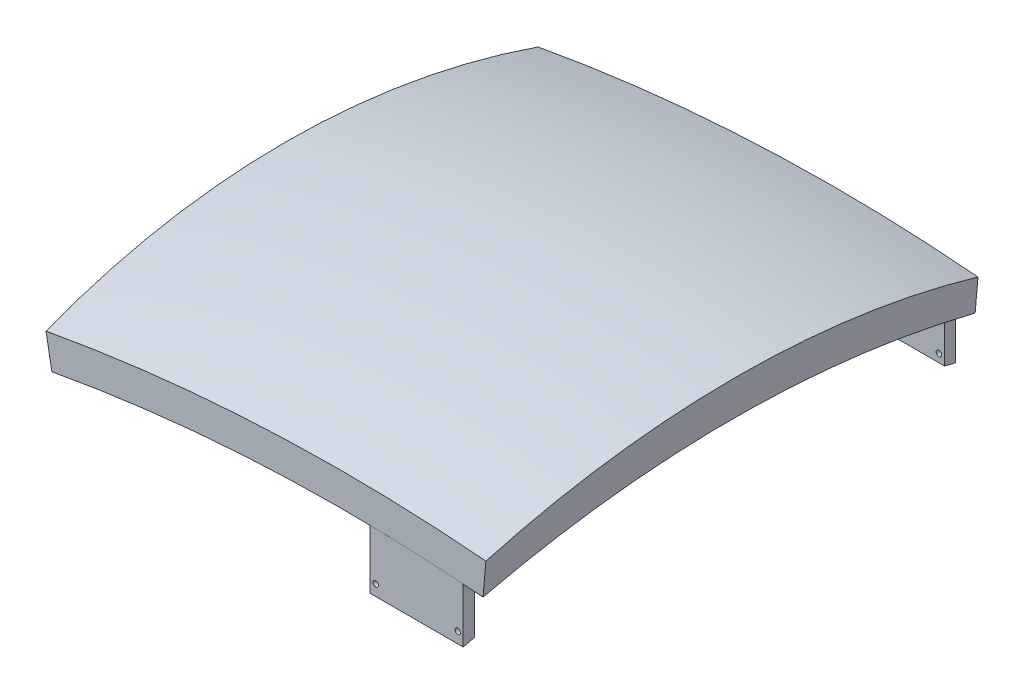
ISO-10303-21;
HEADER;
FILE_DESCRIPTION(('STEP AP214'),'2;1');
FILE_NAME('part.step','',(''),(''),'','','');
FILE_SCHEMA(('AUTOMOTIVE_DESIGN { 1 0 10303 214 1 1 1 1 }'));
ENDSEC;
DATA;
#1=APPLICATION_CONTEXT('core data for automotive mechanical design processes');
#2=APPLICATION_PROTOCOL_DEFINITION('international standard','automotive_design',2000,#1);
#3=PRODUCT_CONTEXT('',#1,'mechanical');
#4=PRODUCT('Part','Part','',(#3));
#5=PRODUCT_RELATED_PRODUCT_CATEGORY('part','',(#4));
#6=PRODUCT_DEFINITION_FORMATION('','',#4);
#7=PRODUCT_DEFINITION_CONTEXT('part definition',#1,'design');
#8=PRODUCT_DEFINITION('design','',#6,#7);
#9=PRODUCT_DEFINITION_SHAPE('','',#8);
#10=(LENGTH_UNIT() NAMED_UNIT(*) SI_UNIT(.MILLI.,.METRE.));
#11=(NAMED_UNIT(*) PLANE_ANGLE_UNIT() SI_UNIT($,.RADIAN.));
#12=(NAMED_UNIT(*) SI_UNIT($,.STERADIAN.) SOLID_ANGLE_UNIT());
#13=UNCERTAINTY_MEASURE_WITH_UNIT(LENGTH_MEASURE(1.E-05),#10,'distance_accuracy_value','');
#14=(GEOMETRIC_REPRESENTATION_CONTEXT(3) GLOBAL_UNCERTAINTY_ASSIGNED_CONTEXT((#13)) GLOBAL_UNIT_ASSIGNED_CONTEXT((#10,
#11,#12)) REPRESENTATION_CONTEXT('',''));
#15=CARTESIAN_POINT('',(0.,0.,0.));
#16=DIRECTION('',(0.,0.,1.));
#17=DIRECTION('',(1.,0.,0.));
#18=AXIS2_PLACEMENT_3D('',#15,#16,#17);
#19=CARTESIAN_POINT('',(-219.195268192516,-98.7339113805505,-865.268315258509));
#20=CARTESIAN_POINT('',(-217.485366303671,-79.0776369283012,-792.006366117884));
#21=CARTESIAN_POINT('',(-216.193649015425,-64.2286273617793,-717.445612604587));
#22=CARTESIAN_POINT('',(-214.468851463222,-44.4011189780223,-567.012192223802));
#23=CARTESIAN_POINT('',(-214.035783708367,-39.4227639622768,-491.140442852515));
#24=CARTESIAN_POINT('',(-214.035783708367,-39.4227639622768,-339.396187664504));
#25=CARTESIAN_POINT('',(-214.468851463254,-44.4011189781346,-263.524438293525));
#26=CARTESIAN_POINT('',(-216.193649015392,-64.2286273616665,-113.091017912124));
#27=CARTESIAN_POINT('',(-217.485366302315,-79.0776369269274,-38.5302643989419));
#28=CARTESIAN_POINT('',(-219.195268192516,-98.7339113805503,34.73168474149));
#29=CARTESIAN_POINT('',(-219.195268192516,-206.506789336191,-865.268315258509));
#30=CARTESIAN_POINT('',(-217.485366302605,-186.850514885903,-792.006366117348));
#31=CARTESIAN_POINT('',(-216.193649014372,-172.001505317683,-717.445612604587));
#32=CARTESIAN_POINT('',(-214.468851464275,-152.173996933399,-567.012192223802));
#33=CARTESIAN_POINT('',(-214.035783708367,-147.195641917917,-491.140442852515));
#34=CARTESIAN_POINT('',(-214.035783708367,-147.195641917917,-339.396187664504));
#35=CARTESIAN_POINT('',(-214.468851464307,-152.173996933775,-263.524438293525));
#36=CARTESIAN_POINT('',(-216.193649014339,-172.001505317307,-113.091017912124));
#37=CARTESIAN_POINT('',(-217.485366301263,-186.850514882578,-38.5302643989017));
#38=CARTESIAN_POINT('',(-219.195268192516,-206.50678933619,34.73168474149));
#39=B_SPLINE_SURFACE_WITH_KNOTS('',1,3,((#19,#20,#21,#22,#23,#24,#25,#26,#27,#28),(#29,#30,#31,
#32,#33,#34,#35,#36,#37,#38)),.UNSPECIFIED.,.F.,.F.,.F.,(2,2),(4,2,2,2,4),(0.,1.),(0.,0.25,0.5,
0.75,1.),.UNSPECIFIED.);
#40=CARTESIAN_POINT('',(-219.195268192516,-206.506789336191,-865.268315258509));
#41=CARTESIAN_POINT('',(-217.485366302605,-186.850514885903,-792.006366117348));
#42=CARTESIAN_POINT('',(-216.193649014372,-172.001505317683,-717.445612604587));
#43=CARTESIAN_POINT('',(-214.468851464275,-152.173996933399,-567.012192223802));
#44=CARTESIAN_POINT('',(-214.035783708367,-147.195641917917,-491.140442852515));
#45=CARTESIAN_POINT('',(-214.035783708367,-147.195641917917,-339.396187664504));
#46=CARTESIAN_POINT('',(-214.468851464307,-152.173996933775,-263.524438293525));
#47=CARTESIAN_POINT('',(-216.193649014339,-172.001505317307,-113.091017912124));
#48=CARTESIAN_POINT('',(-217.485366301263,-186.850514882578,-38.5302643989017));
#49=CARTESIAN_POINT('',(-219.195268192516,-206.50678933619,34.73168474149));
#50=B_SPLINE_CURVE_WITH_KNOTS('',3,(#40,#41,#42,#43,#44,#45,#46,#47,#48,#49),.UNSPECIFIED.,.F.,
.F.,(4,2,2,2,4),(0.,0.25,0.5,0.75,1.),.UNSPECIFIED.);
#51=CARTESIAN_POINT('',(-219.195268192516,-206.506789336191,-865.268315258509));
#52=VERTEX_POINT('',#51);
#53=CARTESIAN_POINT('',(-218.739580226814,-201.26840240285,-845.268315258514));
#54=VERTEX_POINT('',#53);
#55=EDGE_CURVE('E219',#52,#54,#50,.T.);
#56=DIRECTION('',(0.,-1.,0.));
#57=VECTOR('',#56,1.);
#58=CARTESIAN_POINT('',(-218.739580226945,-147.38196342479,-845.268315258511));
#59=LINE('',#58,#57);
#60=CARTESIAN_POINT('',(-218.739580227065,-97.7440306788102,-845.268315258511));
#61=VERTEX_POINT('',#60);
#62=EDGE_CURVE('E220',#54,#61,#59,.F.);
#63=CARTESIAN_POINT('',(-218.739580226757,-97.7440306788183,14.73168474149));
#64=CARTESIAN_POINT('',(-218.481045617461,-94.7718740416983,3.10227884839648));
#65=CARTESIAN_POINT('',(-218.233007043952,-91.9204504764158,-8.55821000765438));
#66=CARTESIAN_POINT('',(-217.758010429182,-86.4600382829347,-31.9362531011561));
#67=CARTESIAN_POINT('',(-217.531052406274,-83.8510498657967,-43.653807388278));
#68=CARTESIAN_POINT('',(-217.098305647735,-78.8764801459516,-67.1408690052781));
#69=CARTESIAN_POINT('',(-216.892516927377,-76.5108990188499,-78.9103763726312));
#70=CARTESIAN_POINT('',(-216.502199190425,-72.024132406901,-102.496134448474));
#71=CARTESIAN_POINT('',(-216.317670011581,-69.902945056867,-114.312384799514));
#72=CARTESIAN_POINT('',(-215.969956777993,-65.9059130777401,-137.986640441112));
#73=CARTESIAN_POINT('',(-215.806772708132,-64.0300682748843,-149.844645702091));
#74=CARTESIAN_POINT('',(-215.501842763979,-60.5247001433336,-173.597173539191));
#75=CARTESIAN_POINT('',(-215.360096871139,-58.8951766015351,-185.49169608371));
#76=CARTESIAN_POINT('',(-215.032619845686,-55.1304710677959,-215.267585357409));
#77=CARTESIAN_POINT('',(-214.860330416848,-53.1498160248504,-233.168873438359));
#78=CARTESIAN_POINT('',(-214.564245480463,-49.7460895757775,-269.024566644472));
#79=CARTESIAN_POINT('',(-214.440450030154,-48.3230188277595,-286.978971832304));
#80=CARTESIAN_POINT('',(-214.241453647593,-46.0355248457006,-322.923523366602));
#81=CARTESIAN_POINT('',(-214.166252337814,-45.1710972715687,-340.913669434309));
#82=CARTESIAN_POINT('',(-214.06454155387,-44.0019672786973,-376.912252910115));
#83=CARTESIAN_POINT('',(-214.038032035951,-43.6972643569826,-394.920690301762));
#84=CARTESIAN_POINT('',(-214.033803941075,-43.648665112757,-430.987559670267));
#85=CARTESIAN_POINT('',(-214.056218927852,-43.9063039814452,-449.045993752219));
#86=CARTESIAN_POINT('',(-214.150017971697,-44.9844872690918,-485.145947630889));
#87=CARTESIAN_POINT('',(-214.22140208572,-45.8050323427405,-503.187467407911));
#88=CARTESIAN_POINT('',(-214.413038157668,-48.0079117684511,-539.236078935358));
#89=CARTESIAN_POINT('',(-214.533290711532,-49.3902529714702,-557.243170263246));
#90=CARTESIAN_POINT('',(-214.82256365381,-52.7156508187346,-593.205344225949));
#91=CARTESIAN_POINT('',(-214.991584050626,-54.6587075595779,-611.160426851804));
#92=CARTESIAN_POINT('',(-215.3159186747,-58.3872973151918,-641.219283932251));
#93=CARTESIAN_POINT('',(-215.458066266041,-60.0214531874664,-653.342201643204));
#94=CARTESIAN_POINT('',(-215.764627681726,-63.5455947902092,-677.550647209227));
#95=CARTESIAN_POINT('',(-215.929041568527,-65.4355812382835,-689.63617495932));
#96=CARTESIAN_POINT('',(-216.280035721191,-69.4703331107285,-713.764296613171));
#97=CARTESIAN_POINT('',(-216.46661602529,-71.6150989745785,-725.806890442833));
#98=CARTESIAN_POINT('',(-216.861855813529,-76.1584439382319,-749.844050650542));
#99=CARTESIAN_POINT('',(-217.070515834092,-78.5570292045456,-761.838615854388));
#100=CARTESIAN_POINT('',(-217.509816997251,-83.6069395483329,-785.773998357609));
#101=CARTESIAN_POINT('',(-217.740458103276,-86.2582642053333,-797.714815746367));
#102=CARTESIAN_POINT('',(-218.223627295504,-91.8126219802084,-821.537283685952));
#103=CARTESIAN_POINT('',(-218.476155321272,-94.7156544030591,-833.418934400057));
#104=CARTESIAN_POINT('',(-218.739580227065,-97.7440306788108,-845.268315258511));
#105=B_SPLINE_CURVE_WITH_KNOTS('',3,(#63,#64,#65,#66,#67,#68,#69,#70,#71,#72,#73,#74,#75,#76,
#77,#78,#79,#80,#81,#82,#83,#84,#85,#86,#87,#88,#89,#90,#91,#92,#93,#94,#95,#96,#97,#98,#99,
#100,#101,#102,#103,#104),.UNSPECIFIED.,.F.,.F.,(4,2,2,2,2,2,2,2,2,2,2,2,2,2,2,2,2,2,2,2,4),(0.,
36.0172890600043,72.0346094758565,108.051955876107,144.069027377649,180.086073370099,
216.103088202398,270.127818488676,324.152612539441,378.176986867295,432.20131264818,
486.373309084038,540.545368524967,594.718088599856,648.890818007439,685.588467501293,
722.286219934372,758.984035669795,795.682743178815,832.38138963463,869.07993476014),.UNSPECIFIED.);
#106=CARTESIAN_POINT('',(-218.739580226757,-97.7440306788182,14.73168474149));
#107=VERTEX_POINT('',#106);
#108=EDGE_CURVE('E126',#107,#61,#105,.T.);
#109=DIRECTION('',(0.,-1.,0.));
#110=VECTOR('',#109,1.);
#111=CARTESIAN_POINT('',(-218.739580226638,-147.381963424225,14.73168474149));
#112=LINE('',#111,#110);
#113=CARTESIAN_POINT('',(-218.739580226507,-201.268402402045,14.7316847414923));
#114=VERTEX_POINT('',#113);
#115=EDGE_CURVE('E125',#114,#107,#112,.F.);
#116=CARTESIAN_POINT('',(-219.195268192516,-206.50678933619,34.73168474149));
#117=VERTEX_POINT('',#116);
#118=EDGE_CURVE('E226',#114,#117,#50,.T.);
#119=DIRECTION('',(0.,-1.,0.));
#120=VECTOR('',#119,1.);
#121=CARTESIAN_POINT('',(-219.195268192516,-206.50678933619,34.73168474149));
#122=LINE('',#121,#120);
#123=CARTESIAN_POINT('',(-219.195268192516,-98.7339113805503,34.73168474149));
#124=VERTEX_POINT('',#123);
#125=EDGE_CURVE('E229',#124,#117,#122,.T.);
#126=CARTESIAN_POINT('',(-219.195268192516,-98.7339113805505,-865.268315258509));
#127=CARTESIAN_POINT('',(-217.485366303671,-79.0776369283012,-792.006366117884));
#128=CARTESIAN_POINT('',(-216.193649015425,-64.2286273617793,-717.445612604587));
#129=CARTESIAN_POINT('',(-214.468851463222,-44.4011189780223,-567.012192223802));
#130=CARTESIAN_POINT('',(-214.035783708367,-39.4227639622768,-491.140442852515));
#131=CARTESIAN_POINT('',(-214.035783708367,-39.4227639622768,-339.396187664504));
#132=CARTESIAN_POINT('',(-214.468851463254,-44.4011189781346,-263.524438293525));
#133=CARTESIAN_POINT('',(-216.193649015392,-64.2286273616665,-113.091017912124));
#134=CARTESIAN_POINT('',(-217.485366302315,-79.0776369269274,-38.5302643989419));
#135=CARTESIAN_POINT('',(-219.195268192516,-98.7339113805503,34.73168474149));
#136=B_SPLINE_CURVE_WITH_KNOTS('',3,(#126,#127,#128,#129,#130,#131,#132,#133,#134,#135),
.UNSPECIFIED.,.F.,.F.,(4,2,2,2,4),(0.,0.25,0.5,0.75,1.),.UNSPECIFIED.);
#137=CARTESIAN_POINT('',(-219.195268192516,-98.7339113805505,-865.268315258509));
#138=VERTEX_POINT('',#137);
#139=EDGE_CURVE('E253',#138,#124,#136,.T.);
#140=DIRECTION('',(0.,-1.,0.));
#141=VECTOR('',#140,1.);
#142=CARTESIAN_POINT('',(-219.195268192516,-206.506789336191,-865.268315258509));
#143=LINE('',#142,#141);
#144=EDGE_CURVE('E222',#138,#52,#143,.T.);
#145=ORIENTED_EDGE('',*,*,#55,.T.);
#146=ORIENTED_EDGE('',*,*,#62,.T.);
#147=ORIENTED_EDGE('',*,*,#108,.F.);
#148=ORIENTED_EDGE('',*,*,#115,.F.);
#149=ORIENTED_EDGE('',*,*,#118,.T.);
#150=ORIENTED_EDGE('',*,*,#125,.F.);
#151=ORIENTED_EDGE('',*,*,#139,.F.);
#152=ORIENTED_EDGE('',*,*,#144,.T.);
#153=EDGE_LOOP('',(#145,#146,#147,#148,#149,#150,#151,#152));
#154=FACE_BOUND('',#153,.T.);
#155=ADVANCED_FACE('F45',(#154),#39,.T.);
#156=CARTESIAN_POINT('',(-219.195268192516,-206.506789336191,-865.268315258509));
#157=CARTESIAN_POINT('',(-217.485366302605,-186.850514885903,-792.006366117348));
#158=CARTESIAN_POINT('',(-216.193649014372,-172.001505317683,-717.445612604587));
#159=CARTESIAN_POINT('',(-214.468851464275,-152.173996933399,-567.012192223802));
#160=CARTESIAN_POINT('',(-214.035783708367,-147.195641917917,-491.140442852515));
#161=CARTESIAN_POINT('',(-214.035783708367,-147.195641917917,-339.396187664504));
#162=CARTESIAN_POINT('',(-214.468851464307,-152.173996933775,-263.524438293525));
#163=CARTESIAN_POINT('',(-216.193649014339,-172.001505317307,-113.091017912124));
#164=CARTESIAN_POINT('',(-217.485366301263,-186.850514882578,-38.5302643989017));
#165=CARTESIAN_POINT('',(-219.195268192516,-206.50678933619,34.73168474149));
#166=CARTESIAN_POINT('',(-49.1952681925156,-206.506789336191,-865.268315258509));
#167=CARTESIAN_POINT('',(-47.4853663031311,-186.850514885898,-792.006366117327));
#168=CARTESIAN_POINT('',(-46.1936490148982,-172.001505317683,-717.445612604587));
#169=CARTESIAN_POINT('',(-44.468851463748,-152.173996933399,-567.012192223802));
#170=CARTESIAN_POINT('',(-44.0357837083669,-147.195641917917,-491.140442852515));
#171=CARTESIAN_POINT('',(-44.0357837083669,-147.195641917917,-339.396187664504));
#172=CARTESIAN_POINT('',(-44.4688514637807,-152.173996933775,-263.524438293525));
#173=CARTESIAN_POINT('',(-46.1936490148655,-172.001505317307,-113.091017912124));
#174=CARTESIAN_POINT('',(-47.485366301789,-186.850514882573,-38.5302643989218));
#175=CARTESIAN_POINT('',(-49.1952681925156,-206.50678933619,34.73168474149));
#176=B_SPLINE_SURFACE_WITH_KNOTS('',1,3,((#156,#157,#158,#159,#160,#161,#162,#163,#164,#165),
(#166,#167,#168,#169,#170,#171,#172,#173,#174,#175)),.UNSPECIFIED.,.F.,.F.,.F.,(2,2),(4,2,2,2,
4),(0.,1.),(0.,0.25,0.5,0.75,1.),.UNSPECIFIED.);
#177=CARTESIAN_POINT('',(-49.1952681925156,-206.506789336191,-865.268315258509));
#178=CARTESIAN_POINT('',(-47.4853663031311,-186.850514885898,-792.006366117327));
#179=CARTESIAN_POINT('',(-46.1936490148982,-172.001505317683,-717.445612604587));
#180=CARTESIAN_POINT('',(-44.468851463748,-152.173996933399,-567.012192223802));
#181=CARTESIAN_POINT('',(-44.0357837083669,-147.195641917917,-491.140442852515));
#182=CARTESIAN_POINT('',(-44.0357837083669,-147.195641917917,-339.396187664504));
#183=CARTESIAN_POINT('',(-44.4688514637807,-152.173996933775,-263.524438293525));
#184=CARTESIAN_POINT('',(-46.1936490148655,-172.001505317307,-113.091017912124));
#185=CARTESIAN_POINT('',(-47.485366301789,-186.850514882573,-38.5302643989218));
#186=CARTESIAN_POINT('',(-49.1952681925156,-206.50678933619,34.73168474149));
#187=B_SPLINE_CURVE_WITH_KNOTS('',3,(#177,#178,#179,#180,#181,#182,#183,#184,#185,#186),
.UNSPECIFIED.,.F.,.F.,(4,2,2,2,4),(0.,0.25,0.5,0.75,1.),.UNSPECIFIED.);
#188=CARTESIAN_POINT('',(-49.1952681925156,-206.506789336191,-865.268315258509));
#189=VERTEX_POINT('',#188);
#190=CARTESIAN_POINT('',(-48.7395802269433,-201.268402402833,-845.268315258447));
#191=VERTEX_POINT('',#190);
#192=EDGE_CURVE('E241',#189,#191,#187,.T.);
#193=DIRECTION('',(1.,0.,0.));
#194=VECTOR('',#193,1.);
#195=CARTESIAN_POINT('',(-133.739580226879,-201.268402402849,-845.268315258512));
#196=LINE('',#195,#194);
#197=EDGE_CURVE('E276',#191,#54,#196,.F.);
#198=DIRECTION('',(1.,0.,0.));
#199=VECTOR('',#198,1.);
#200=CARTESIAN_POINT('',(-49.1952681925156,-206.506789336191,-865.268315258509));
#201=LINE('',#200,#199);
#202=EDGE_CURVE('E235',#52,#189,#201,.T.);
#203=ORIENTED_EDGE('',*,*,#192,.T.);
#204=ORIENTED_EDGE('',*,*,#197,.T.);
#205=ORIENTED_EDGE('',*,*,#55,.F.);
#206=ORIENTED_EDGE('',*,*,#202,.T.);
#207=EDGE_LOOP('',(#203,#204,#205,#206));
#208=FACE_BOUND('',#207,.T.);
#209=ADVANCED_FACE('F206',(#208),#176,.T.);
#210=CARTESIAN_POINT('',(-49.1952681925156,-206.506789336191,-865.268315258509));
#211=CARTESIAN_POINT('',(-47.4853663031311,-186.850514885898,-792.006366117327));
#212=CARTESIAN_POINT('',(-46.1936490148982,-172.001505317683,-717.445612604587));
#213=CARTESIAN_POINT('',(-44.468851463748,-152.173996933399,-567.012192223802));
#214=CARTESIAN_POINT('',(-44.0357837083669,-147.195641917917,-491.140442852515));
#215=CARTESIAN_POINT('',(-44.0357837083669,-147.195641917917,-339.396187664504));
#216=CARTESIAN_POINT('',(-44.4688514637807,-152.173996933775,-263.524438293525));
#217=CARTESIAN_POINT('',(-46.1936490148655,-172.001505317307,-113.091017912124));
#218=CARTESIAN_POINT('',(-47.485366301789,-186.850514882573,-38.5302643989218));
#219=CARTESIAN_POINT('',(-49.1952681925156,-206.50678933619,34.73168474149));
#220=CARTESIAN_POINT('',(-49.1952681925156,-106.506789336191,-865.268315258509));
#221=CARTESIAN_POINT('',(-47.4853663031446,-86.8505148839466,-792.006366117904));
#222=CARTESIAN_POINT('',(-46.1936490148983,-72.0015053174194,-717.445612604587));
#223=CARTESIAN_POINT('',(-44.468851463748,-52.1739969336624,-567.012192223802));
#224=CARTESIAN_POINT('',(-44.0357837083669,-47.1956419179169,-491.140442852515));
#225=CARTESIAN_POINT('',(-44.0357837083669,-47.1956419179169,-339.396187664504));
#226=CARTESIAN_POINT('',(-44.4688514637807,-52.1739969337747,-263.524438293525));
#227=CARTESIAN_POINT('',(-46.1936490148656,-72.0015053173066,-113.091017912124));
#228=CARTESIAN_POINT('',(-47.485366301789,-86.8505148825729,-38.5302643989218));
#229=CARTESIAN_POINT('',(-49.1952681925156,-106.50678933619,34.73168474149));
#230=B_SPLINE_SURFACE_WITH_KNOTS('',1,3,((#210,#211,#212,#213,#214,#215,#216,#217,#218,#219),
(#220,#221,#222,#223,#224,#225,#226,#227,#228,#229)),.UNSPECIFIED.,.F.,.F.,.F.,(2,2),(4,2,2,2,
4),(0.,1.),(0.,0.25,0.5,0.75,1.),.UNSPECIFIED.);
#231=CARTESIAN_POINT('',(-48.7395802269449,-106.166152363015,-845.268315258511));
#232=CARTESIAN_POINT('',(-48.4997927060009,-103.409514476734,-834.482190590487));
#233=CARTESIAN_POINT('',(-48.2690341609484,-100.756735094708,-823.669325377308));
#234=CARTESIAN_POINT('',(-47.8256560831552,-95.6597859777624,-801.994694335733));
#235=CARTESIAN_POINT('',(-47.6130357152305,-93.2156066377179,-791.132930783165));
#236=CARTESIAN_POINT('',(-47.2059975743385,-88.5365493181958,-769.364336523797));
#237=CARTESIAN_POINT('',(-47.0115793874354,-86.3016665791035,-758.457506847739));
#238=CARTESIAN_POINT('',(-46.6409764577681,-82.0415191552481,-736.600586493243));
#239=CARTESIAN_POINT('',(-46.4647950801467,-80.0162931573342,-725.65048821631));
#240=CARTESIAN_POINT('',(-46.1307737215798,-76.1766609661005,-703.712871271688));
#241=CARTESIAN_POINT('',(-45.9729341641893,-74.3622596412082,-692.725351745886));
#242=CARTESIAN_POINT('',(-45.6756632670642,-70.9450131260803,-670.716621186454));
#243=CARTESIAN_POINT('',(-45.5362327822981,-69.3421777615563,-659.695408612331));
#244=CARTESIAN_POINT('',(-45.3359977635347,-67.040271053134,-642.721633368709));
#245=CARTESIAN_POINT('',(-45.2686239767274,-66.2657227003317,-636.779290970337));
#246=CARTESIAN_POINT('',(-45.1392362456257,-64.7782523621493,-624.886838532706));
#247=CARTESIAN_POINT('',(-45.0772223056712,-64.0653304266685,-618.936728487161));
#248=CARTESIAN_POINT('',(-44.8992198777421,-62.0190030896313,-601.075177963318));
#249=CARTESIAN_POINT('',(-44.7912756011932,-60.7780915642274,-589.152925681588));
#250=CARTESIAN_POINT('',(-44.5968705596351,-58.5432709062276,-565.28497732199));
#251=CARTESIAN_POINT('',(-44.5104102243806,-57.5493667146501,-553.33928077997));
#252=CARTESIAN_POINT('',(-44.3590046248175,-55.8089086828762,-529.429822671306));
#253=CARTESIAN_POINT('',(-44.2940591653576,-55.0623525991013,-517.466061269508));
#254=CARTESIAN_POINT('',(-44.1856942908095,-53.8167011091878,-493.521659263651));
#255=CARTESIAN_POINT('',(-44.1422819490208,-53.3176870167998,-481.541014407908));
#256=CARTESIAN_POINT('',(-44.0770449394077,-52.5678125074836,-457.571922286448));
#257=CARTESIAN_POINT('',(-44.0552200582146,-52.3169496378501,-445.583475099022));
#258=CARTESIAN_POINT('',(-44.0386950325646,-52.1270066622894,-427.59889578211));
#259=CARTESIAN_POINT('',(-44.0358888251728,-52.0947518705125,-421.60362161028));
#260=CARTESIAN_POINT('',(-44.0356843901524,-52.0924020557646,-409.613060936252));
#261=CARTESIAN_POINT('',(-44.038286161562,-52.1223070217396,-403.617774434056));
#262=CARTESIAN_POINT('',(-44.0541988070907,-52.305211054658,-385.632334892222));
#263=CARTESIAN_POINT('',(-44.0756173871996,-52.551403563506,-373.64300990617));
#264=CARTESIAN_POINT('',(-44.1419284872124,-53.3136238849951,-348.9713925383));
#265=CARTESIAN_POINT('',(-44.1881202230086,-53.8445863707358,-336.289568016809));
#266=CARTESIAN_POINT('',(-44.3046613854443,-55.1842257142146,-310.939842146273));
#267=CARTESIAN_POINT('',(-44.3750124273419,-55.9929211407971,-298.271941785004));
#268=CARTESIAN_POINT('',(-44.5398411410547,-57.8876883175067,-272.956425738021));
#269=CARTESIAN_POINT('',(-44.6343200192068,-58.9737739365122,-260.308811098372));
#270=CARTESIAN_POINT('',(-44.8473696266328,-61.4229385857388,-235.040199412464));
#271=CARTESIAN_POINT('',(-44.9659411676493,-62.7860269488807,-222.419203277528));
#272=CARTESIAN_POINT('',(-45.2271476267619,-65.7888951853232,-197.210183401109));
#273=CARTESIAN_POINT('',(-45.369782987875,-67.4286801526306,-184.622160270994));
#274=CARTESIAN_POINT('',(-45.6791533179987,-70.9851472275996,-159.477128466891));
#275=CARTESIAN_POINT('',(-45.8459041030342,-72.9020110561489,-146.920145690856));
#276=CARTESIAN_POINT('',(-46.2033202563663,-77.0105998081788,-121.851765174091));
#277=CARTESIAN_POINT('',(-46.3939852639462,-79.2023205857796,-109.340366748706));
#278=CARTESIAN_POINT('',(-46.799123182445,-83.8594427508777,-84.3693788106656));
#279=CARTESIAN_POINT('',(-47.0135953919551,-86.3248360754228,-71.9097877828724));
#280=CARTESIAN_POINT('',(-47.4662371216634,-91.5280911505299,-47.048632411625));
#281=CARTESIAN_POINT('',(-47.7044055986607,-94.2659409065128,-34.6470655388689));
#282=CARTESIAN_POINT('',(-48.2043282758789,-100.012883454905,-9.90817799385694));
#283=CARTESIAN_POINT('',(-48.4660811049674,-103.021960478877,2.42914636923478));
#284=CARTESIAN_POINT('',(-48.7395802266375,-106.166152363038,14.73168474149));
#285=B_SPLINE_CURVE_WITH_KNOTS('',3,(#231,#232,#233,#234,#235,#236,#237,#238,#239,#240,#241,
#242,#243,#244,#245,#246,#247,#248,#249,#250,#251,#252,#253,#254,#255,#256,#257,#258,#259,#260,
#261,#262,#263,#264,#265,#266,#267,#268,#269,#270,#271,#272,#273,#274,#275,#276,#277,#278,#279,
#280,#281,#282,#283,#284),.UNSPECIFIED.,.F.,.F.,(4,2,2,2,2,2,2,2,2,2,2,2,2,2,2,2,2,2,2,2,2,2,2,
2,2,2,4),(0.,33.4056623431491,66.8097856700824,100.213149169176,133.622665468603,
167.032953117494,200.444791887499,218.423465666414,236.402154002654,272.360767487834,
308.320100214274,344.279106761553,380.24991748259,416.220372667702,434.206178038401,
452.191980210649,488.164808648682,526.240829767894,564.319397093558,602.399868633769,
640.481623413861,678.564079358659,716.671625792341,754.778597489547,792.884446775342,
830.988619236702,869.090577849042),.UNSPECIFIED.);
#286=CARTESIAN_POINT('',(-48.7395802269449,-106.166152363015,-845.268315258511));
#287=VERTEX_POINT('',#286);
#288=CARTESIAN_POINT('',(-48.7395802266371,-106.166152363037,14.73168474149));
#289=VERTEX_POINT('',#288);
#290=EDGE_CURVE('E113',#287,#289,#285,.T.);
#291=DIRECTION('',(0.,1.,0.));
#292=VECTOR('',#291,1.);
#293=CARTESIAN_POINT('',(-48.7395802269448,-151.26840240261,-845.268315258512));
#294=LINE('',#293,#292);
#295=EDGE_CURVE('E12',#287,#191,#294,.F.);
#296=DIRECTION('',(0.,1.,0.));
#297=VECTOR('',#296,1.);
#298=CARTESIAN_POINT('',(-49.1952681925156,-106.506789336191,-865.268315258509));
#299=LINE('',#298,#297);
#300=CARTESIAN_POINT('',(-49.1952681925157,-106.506789336191,-865.268315258509));
#301=VERTEX_POINT('',#300);
#302=EDGE_CURVE('E239',#189,#301,#299,.T.);
#303=CARTESIAN_POINT('',(-49.1952681925158,-106.506789336191,-865.268315258509));
#304=CARTESIAN_POINT('',(-47.4853663031448,-86.8505148839468,-792.006366117904));
#305=CARTESIAN_POINT('',(-46.1936490148984,-72.0015053174196,-717.445612604587));
#306=CARTESIAN_POINT('',(-44.4688514637482,-52.1739969336626,-567.012192223802));
#307=CARTESIAN_POINT('',(-44.0357837083671,-47.1956419179171,-491.140442852515));
#308=CARTESIAN_POINT('',(-44.0357837083671,-47.1956419179171,-339.396187664504));
#309=CARTESIAN_POINT('',(-44.4688514637809,-52.1739969337749,-263.524438293525));
#310=CARTESIAN_POINT('',(-46.1936490148657,-72.0015053173068,-113.091017912124));
#311=CARTESIAN_POINT('',(-47.4853663017891,-86.8505148825731,-38.5302643989218));
#312=CARTESIAN_POINT('',(-49.1952681925158,-106.506789336191,34.73168474149));
#313=B_SPLINE_CURVE_WITH_KNOTS('',3,(#303,#304,#305,#306,#307,#308,#309,#310,#311,#312),
.UNSPECIFIED.,.F.,.F.,(4,2,2,2,4),(0.,0.25,0.5,0.75,1.),.UNSPECIFIED.);
#314=CARTESIAN_POINT('',(-49.1952681925157,-106.506789336191,34.73168474149));
#315=VERTEX_POINT('',#314);
#316=EDGE_CURVE('E251',#301,#315,#313,.T.);
#317=DIRECTION('',(0.,1.,0.));
#318=VECTOR('',#317,1.);
#319=CARTESIAN_POINT('',(-49.1952681925156,-106.50678933619,34.73168474149));
#320=LINE('',#319,#318);
#321=CARTESIAN_POINT('',(-49.1952681925156,-206.50678933619,34.73168474149));
#322=VERTEX_POINT('',#321);
#323=EDGE_CURVE('E120',#322,#315,#320,.T.);
#324=CARTESIAN_POINT('',(-48.7395802266375,-201.268402402045,14.73168474149));
#325=VERTEX_POINT('',#324);
#326=EDGE_CURVE('E70',#325,#322,#187,.T.);
#327=DIRECTION('',(0.,1.,0.));
#328=VECTOR('',#327,1.);
#329=CARTESIAN_POINT('',(-48.7395802266375,-151.268402402045,14.73168474149));
#330=LINE('',#329,#328);
#331=EDGE_CURVE('E54',#289,#325,#330,.F.);
#332=ORIENTED_EDGE('',*,*,#290,.F.);
#333=ORIENTED_EDGE('',*,*,#295,.T.);
#334=ORIENTED_EDGE('',*,*,#192,.F.);
#335=ORIENTED_EDGE('',*,*,#302,.T.);
#336=ORIENTED_EDGE('',*,*,#316,.T.);
#337=ORIENTED_EDGE('',*,*,#323,.F.);
#338=ORIENTED_EDGE('',*,*,#326,.F.);
#339=ORIENTED_EDGE('',*,*,#331,.F.);
#340=EDGE_LOOP('',(#332,#333,#334,#335,#336,#337,#338,#339));
#341=FACE_BOUND('',#340,.T.);
#342=ADVANCED_FACE('F128',(#341),#230,.T.);
#343=CARTESIAN_POINT('',(-269.22853641592,-3055.92229707452,-865.268315258509));
#344=DIRECTION('',(0.,0.,1.));
#345=DIRECTION('',(1.,0.,0.));
#346=AXIS2_PLACEMENT_3D('',#343,#344,#345);
#347=PLANE('',#346);
#348=CARTESIAN_POINT('',(-59.1952681925157,-186.506789336191,-865.268315258512));
#349=DIRECTION('',(0.,0.,1.));
#350=DIRECTION('',(1.,0.,0.));
#351=AXIS2_PLACEMENT_3D('',#348,#349,#350);
#352=CIRCLE('',#351,4.99999999999977);
#353=CARTESIAN_POINT('',(-54.1952681925159,-186.506789336191,-865.268315258512));
#354=VERTEX_POINT('',#353);
#355=EDGE_CURVE('E289',#354,#354,#352,.T.);
#356=ORIENTED_EDGE('',*,*,#355,.T.);
#357=EDGE_LOOP('',(#356));
#358=FACE_BOUND('',#357,.T.);
#359=CARTESIAN_POINT('',(-209.195268192516,-186.506789336191,-865.268315258512));
#360=DIRECTION('',(0.,0.,1.));
#361=DIRECTION('',(1.,0.,0.));
#362=AXIS2_PLACEMENT_3D('',#359,#360,#361);
#363=CIRCLE('',#362,4.99999999999975);
#364=CARTESIAN_POINT('',(-204.195268192516,-186.506789336191,-865.268315258512));
#365=VERTEX_POINT('',#364);
#366=EDGE_CURVE('E141',#365,#365,#363,.T.);
#367=ORIENTED_EDGE('',*,*,#366,.T.);
#368=EDGE_LOOP('',(#367));
#369=FACE_BOUND('',#368,.T.);
#370=CARTESIAN_POINT('',(-269.22853641592,-3055.92229707452,-865.268315258509));
#371=DIRECTION('',(0.,0.,1.));
#372=DIRECTION('',(1.,0.,0.));
#373=AXIS2_PLACEMENT_3D('',#370,#371,#372);
#374=CIRCLE('',#373,2957.61161689841);
#375=EDGE_CURVE('E273',#301,#138,#374,.T.);
#376=ORIENTED_EDGE('',*,*,#375,.F.);
#377=ORIENTED_EDGE('',*,*,#302,.F.);
#378=ORIENTED_EDGE('',*,*,#202,.F.);
#379=ORIENTED_EDGE('',*,*,#144,.F.);
#380=EDGE_LOOP('',(#376,#377,#378,#379));
#381=FACE_BOUND('',#380,.T.);
#382=ADVANCED_FACE('F47',(#358,#369,#381),#347,.F.);
#383=CARTESIAN_POINT('',(-269.22853641592,-3055.92229707452,34.73168474149));
#384=DIRECTION('',(0.,0.,1.));
#385=DIRECTION('',(1.,0.,0.));
#386=AXIS2_PLACEMENT_3D('',#383,#384,#385);
#387=PLANE('',#386);
#388=CARTESIAN_POINT('',(-59.1952681925157,-186.506789336191,34.73168474149));
#389=DIRECTION('',(0.,0.,1.));
#390=DIRECTION('',(1.,0.,0.));
#391=AXIS2_PLACEMENT_3D('',#388,#389,#390);
#392=CIRCLE('',#391,5.025);
#393=CARTESIAN_POINT('',(-54.1702681925157,-186.506789336191,34.73168474149));
#394=VERTEX_POINT('',#393);
#395=EDGE_CURVE('E296',#394,#394,#392,.T.);
#396=ORIENTED_EDGE('',*,*,#395,.F.);
#397=EDGE_LOOP('',(#396));
#398=FACE_BOUND('',#397,.T.);
#399=CARTESIAN_POINT('',(-209.195268192516,-186.506789336191,34.73168474149));
#400=DIRECTION('',(0.,0.,1.));
#401=DIRECTION('',(1.,0.,0.));
#402=AXIS2_PLACEMENT_3D('',#399,#400,#401);
#403=CIRCLE('',#402,5.025);
#404=CARTESIAN_POINT('',(-204.170268192516,-186.506789336191,34.73168474149));
#405=VERTEX_POINT('',#404);
#406=EDGE_CURVE('E152',#405,#405,#403,.T.);
#407=ORIENTED_EDGE('',*,*,#406,.F.);
#408=EDGE_LOOP('',(#407));
#409=FACE_BOUND('',#408,.T.);
#410=CARTESIAN_POINT('',(-269.22853641592,-3055.92229707452,34.73168474149));
#411=DIRECTION('',(0.,0.,1.));
#412=DIRECTION('',(1.,0.,0.));
#413=AXIS2_PLACEMENT_3D('',#410,#411,#412);
#414=CIRCLE('',#413,2957.61161689841);
#415=EDGE_CURVE('E256',#315,#124,#414,.T.);
#416=ORIENTED_EDGE('',*,*,#415,.T.);
#417=ORIENTED_EDGE('',*,*,#125,.T.);
#418=DIRECTION('',(1.,0.,0.));
#419=VECTOR('',#418,1.);
#420=CARTESIAN_POINT('',(-49.1952681925156,-206.50678933619,34.73168474149));
#421=LINE('',#420,#419);
#422=EDGE_CURVE('E225',#117,#322,#421,.T.);
#423=ORIENTED_EDGE('',*,*,#422,.T.);
#424=ORIENTED_EDGE('',*,*,#323,.T.);
#425=EDGE_LOOP('',(#416,#417,#423,#424));
#426=FACE_BOUND('',#425,.T.);
#427=ADVANCED_FACE('F195',(#398,#409,#426),#387,.T.);
#428=CARTESIAN_POINT('',(-49.1952681925158,-106.506789336191,-865.268315258509));
#429=CARTESIAN_POINT('',(-47.4853663031448,-86.8505148839468,-792.006366117904));
#430=CARTESIAN_POINT('',(-46.1936490148984,-72.0015053174196,-717.445612604587));
#431=CARTESIAN_POINT('',(-44.4688514637482,-52.1739969336626,-567.012192223802));
#432=CARTESIAN_POINT('',(-44.0357837083671,-47.1956419179171,-491.140442852515));
#433=CARTESIAN_POINT('',(-44.0357837083671,-47.1956419179171,-339.396187664504));
#434=CARTESIAN_POINT('',(-44.4688514637809,-52.1739969337749,-263.524438293525));
#435=CARTESIAN_POINT('',(-46.1936490148657,-72.0015053173068,-113.091017912124));
#436=CARTESIAN_POINT('',(-47.4853663017891,-86.8505148825731,-38.5302643989218));
#437=CARTESIAN_POINT('',(-49.1952681925158,-106.506789336191,34.73168474149));
#438=CARTESIAN_POINT('',(-105.779553103391,-102.28546985565,-865.268315258509));
#439=CARTESIAN_POINT('',(-104.06965121402,-82.6291954034063,-792.006366117904));
#440=CARTESIAN_POINT('',(-102.777933925774,-67.7801858368791,-717.445612604587));
#441=CARTESIAN_POINT('',(-101.053136374624,-47.952677453122,-567.012192223802));
#442=CARTESIAN_POINT('',(-100.620068619243,-42.9743224373766,-491.140442852515));
#443=CARTESIAN_POINT('',(-100.620068619243,-42.9743224373766,-339.396187664504));
#444=CARTESIAN_POINT('',(-101.053136374656,-47.9526774532344,-263.524438293525));
#445=CARTESIAN_POINT('',(-102.777933925741,-67.7801858367663,-113.091017912124));
#446=CARTESIAN_POINT('',(-104.069651212665,-82.6291954020325,-38.5302643989218));
#447=CARTESIAN_POINT('',(-105.779553103391,-102.28546985565,34.73168474149));
#448=CARTESIAN_POINT('',(-162.46186128114,-99.6937953632405,-865.268315258509));
#449=CARTESIAN_POINT('',(-160.751959391243,-80.0375209110017,-792.006366117923));
#450=CARTESIAN_POINT('',(-159.460242102996,-65.1885113444693,-717.445612604587));
#451=CARTESIAN_POINT('',(-157.735444552899,-45.3610029607122,-567.012192223802));
#452=CARTESIAN_POINT('',(-157.302376796992,-40.3826479449668,-491.140442852515));
#453=CARTESIAN_POINT('',(-157.302376796992,-40.3826479449668,-339.396187664504));
#454=CARTESIAN_POINT('',(-157.735444552932,-45.3610029608246,-263.524438293525));
#455=CARTESIAN_POINT('',(-159.460242102964,-65.1885113443565,-113.091017912124));
#456=CARTESIAN_POINT('',(-160.751959389888,-80.0375209096281,-38.5302643989018));
#457=CARTESIAN_POINT('',(-162.46186128114,-99.6937953632403,34.73168474149));
#458=CARTESIAN_POINT('',(-219.195268192516,-98.7339113805505,-865.268315258509));
#459=CARTESIAN_POINT('',(-217.485366303671,-79.0776369283012,-792.006366117884));
#460=CARTESIAN_POINT('',(-216.193649015425,-64.2286273617793,-717.445612604587));
#461=CARTESIAN_POINT('',(-214.468851463222,-44.4011189780223,-567.012192223802));
#462=CARTESIAN_POINT('',(-214.035783708367,-39.4227639622768,-491.140442852515));
#463=CARTESIAN_POINT('',(-214.035783708367,-39.4227639622768,-339.396187664504));
#464=CARTESIAN_POINT('',(-214.468851463254,-44.4011189781346,-263.524438293525));
#465=CARTESIAN_POINT('',(-216.193649015392,-64.2286273616665,-113.091017912124));
#466=CARTESIAN_POINT('',(-217.485366302315,-79.0776369269274,-38.5302643989419));
#467=CARTESIAN_POINT('',(-219.195268192516,-98.7339113805503,34.73168474149));
#468=(BOUNDED_SURFACE() B_SPLINE_SURFACE(3,3,((#428,#429,#430,#431,#432,#433,#434,#435,#436,
#437),(#438,#439,#440,#441,#442,#443,#444,#445,#446,#447),(#448,#449,#450,#451,#452,#453,#454,
#455,#456,#457),(#458,#459,#460,#461,#462,#463,#464,#465,#466,#467)),.UNSPECIFIED.,.F.,.F.,
.F.) B_SPLINE_SURFACE_WITH_KNOTS((4,4),(4,2,2,2,4),(0.,1.),(0.,0.25,0.5,0.75,1.),
.UNSPECIFIED.) GEOMETRIC_REPRESENTATION_ITEM() RATIONAL_B_SPLINE_SURFACE(((1.,1.,1.,1.,1.,1.,1.,
1.,1.,1.),(0.999724049503536,0.999724049503536,0.999724049503536,0.999724049503536,
0.999724049503536,0.999724049503536,0.999724049503536,0.999724049503536,0.999724049503536,
0.999724049503536),(0.999724049503536,0.999724049503536,0.999724049503536,0.999724049503536,
0.999724049503536,0.999724049503536,0.999724049503536,0.999724049503536,0.999724049503536,
0.999724049503536),(1.,1.,1.,1.,1.,1.,1.,1.,1.,1.))) REPRESENTATION_ITEM('') SURFACE());
#469=ORIENTED_EDGE('',*,*,#139,.T.);
#470=ORIENTED_EDGE('',*,*,#415,.F.);
#471=ORIENTED_EDGE('',*,*,#316,.F.);
#472=ORIENTED_EDGE('',*,*,#375,.T.);
#473=EDGE_LOOP('',(#469,#470,#471,#472));
#474=FACE_BOUND('',#473,.T.);
#475=ADVANCED_FACE('F191',(#474),#468,.T.);
#476=DIRECTION('',(1.,0.,0.));
#477=VECTOR('',#476,1.);
#478=CARTESIAN_POINT('',(-133.739580226572,-201.268402402045,14.73168474149));
#479=LINE('',#478,#477);
#480=EDGE_CURVE('E163',#325,#114,#479,.F.);
#481=ORIENTED_EDGE('',*,*,#480,.F.);
#482=ORIENTED_EDGE('',*,*,#326,.T.);
#483=ORIENTED_EDGE('',*,*,#422,.F.);
#484=ORIENTED_EDGE('',*,*,#118,.F.);
#485=EDGE_LOOP('',(#481,#482,#483,#484));
#486=FACE_BOUND('',#485,.T.);
#487=ADVANCED_FACE('F189',(#486),#176,.T.);
#488=CARTESIAN_POINT('',(-304.486887835321,-3548.47882768045,-845.268315258511));
#489=DIRECTION('',(0.,0.,1.));
#490=DIRECTION('',(1.,0.,0.));
#491=AXIS2_PLACEMENT_3D('',#488,#489,#490);
#492=PLANE('',#491);
#493=CARTESIAN_POINT('',(-59.1952681925157,-186.506789336191,-845.268315258511));
#494=DIRECTION('',(0.,0.,1.));
#495=DIRECTION('',(1.,0.,0.));
#496=AXIS2_PLACEMENT_3D('',#493,#494,#495);
#497=CIRCLE('',#496,4.99999999999982);
#498=CARTESIAN_POINT('',(-54.1952681925158,-186.506789336191,-845.268315258511));
#499=VERTEX_POINT('',#498);
#500=EDGE_CURVE('E294',#499,#499,#497,.T.);
#501=ORIENTED_EDGE('',*,*,#500,.F.);
#502=EDGE_LOOP('',(#501));
#503=FACE_BOUND('',#502,.T.);
#504=CARTESIAN_POINT('',(-209.195268192516,-186.506789336191,-845.268315258511));
#505=DIRECTION('',(0.,0.,1.));
#506=DIRECTION('',(1.,0.,0.));
#507=AXIS2_PLACEMENT_3D('',#504,#505,#506);
#508=CIRCLE('',#507,4.99999999999981);
#509=CARTESIAN_POINT('',(-204.195268192516,-186.506789336191,-845.268315258511));
#510=VERTEX_POINT('',#509);
#511=EDGE_CURVE('E138',#510,#510,#508,.T.);
#512=ORIENTED_EDGE('',*,*,#511,.F.);
#513=EDGE_LOOP('',(#512));
#514=FACE_BOUND('',#513,.T.);
#515=ORIENTED_EDGE('',*,*,#197,.F.);
#516=ORIENTED_EDGE('',*,*,#295,.F.);
#517=CARTESIAN_POINT('',(-304.486887835321,-3548.47882768045,-845.268315258511));
#518=DIRECTION('',(0.,0.,1.));
#519=DIRECTION('',(1.,0.,0.));
#520=AXIS2_PLACEMENT_3D('',#517,#518,#519);
#521=CIRCLE('',#520,3451.8);
#522=EDGE_CURVE('E62',#287,#61,#521,.T.);
#523=ORIENTED_EDGE('',*,*,#522,.T.);
#524=ORIENTED_EDGE('',*,*,#62,.F.);
#525=EDGE_LOOP('',(#515,#516,#523,#524));
#526=FACE_BOUND('',#525,.T.);
#527=ADVANCED_FACE('F186',(#503,#514,#526),#492,.T.);
#528=CARTESIAN_POINT('',(-304.486887835321,-3548.47882768045,14.73168474149));
#529=DIRECTION('',(0.,0.,1.));
#530=DIRECTION('',(1.,0.,0.));
#531=AXIS2_PLACEMENT_3D('',#528,#529,#530);
#532=PLANE('',#531);
#533=CARTESIAN_POINT('',(-59.1952681925157,-186.506789336191,14.73168474149));
#534=DIRECTION('',(0.,0.,1.));
#535=DIRECTION('',(1.,0.,0.));
#536=AXIS2_PLACEMENT_3D('',#533,#534,#535);
#537=CIRCLE('',#536,4.99999999999982);
#538=CARTESIAN_POINT('',(-54.1952681925158,-186.506789336191,14.73168474149));
#539=VERTEX_POINT('',#538);
#540=EDGE_CURVE('E49',#539,#539,#537,.T.);
#541=ORIENTED_EDGE('',*,*,#540,.T.);
#542=EDGE_LOOP('',(#541));
#543=FACE_BOUND('',#542,.T.);
#544=CARTESIAN_POINT('',(-209.195268192516,-186.506789336191,14.73168474149));
#545=DIRECTION('',(0.,0.,1.));
#546=DIRECTION('',(1.,0.,0.));
#547=AXIS2_PLACEMENT_3D('',#544,#545,#546);
#548=CIRCLE('',#547,4.99999999999981);
#549=CARTESIAN_POINT('',(-204.195268192516,-186.506789336191,14.73168474149));
#550=VERTEX_POINT('',#549);
#551=EDGE_CURVE('E140',#550,#550,#548,.T.);
#552=ORIENTED_EDGE('',*,*,#551,.T.);
#553=EDGE_LOOP('',(#552));
#554=FACE_BOUND('',#553,.T.);
#555=ORIENTED_EDGE('',*,*,#115,.T.);
#556=CARTESIAN_POINT('',(-304.486887835321,-3548.47882768045,14.73168474149));
#557=DIRECTION('',(0.,0.,1.));
#558=DIRECTION('',(1.,0.,0.));
#559=AXIS2_PLACEMENT_3D('',#556,#557,#558);
#560=CIRCLE('',#559,3451.8);
#561=EDGE_CURVE('E116',#289,#107,#560,.T.);
#562=ORIENTED_EDGE('',*,*,#561,.F.);
#563=ORIENTED_EDGE('',*,*,#331,.T.);
#564=ORIENTED_EDGE('',*,*,#480,.T.);
#565=EDGE_LOOP('',(#555,#562,#563,#564));
#566=FACE_BOUND('',#565,.T.);
#567=ADVANCED_FACE('F123',(#543,#554,#566),#532,.F.);
#568=CARTESIAN_POINT('',(-44.1952681925157,-106.506789336191,-845.268315258511));
#569=CARTESIAN_POINT('',(-42.6355858709801,-88.5773725102403,-775.114377214448));
#570=CARTESIAN_POINT('',(-41.4581053558733,-75.04157823195,-703.829646447128));
#571=CARTESIAN_POINT('',(-39.8860500806421,-56.9699273676774,-560.118996706791));
#572=CARTESIAN_POINT('',(-39.4914847908438,-52.4341796370404,-487.693805881778));
#573=CARTESIAN_POINT('',(-39.4914847908438,-52.4341796370404,-342.842824635243));
#574=CARTESIAN_POINT('',(-39.8860500806515,-56.9699273677864,-270.417633805343));
#575=CARTESIAN_POINT('',(-41.4581053558638,-75.041578231841,-126.706984074781));
#576=CARTESIAN_POINT('',(-42.6355858726152,-88.5773725094467,-55.4222532987134));
#577=CARTESIAN_POINT('',(-44.1952681925157,-106.506789336191,14.73168474149));
#578=CARTESIAN_POINT('',(-102.448089038476,-102.101546958321,-845.268315258511));
#579=CARTESIAN_POINT('',(-100.88840671694,-84.1721301323589,-775.114377214402));
#580=CARTESIAN_POINT('',(-99.7109262018339,-70.6363358543314,-703.829646447128));
#581=CARTESIAN_POINT('',(-98.1388709266027,-52.5646849895562,-560.118996706791));
#582=CARTESIAN_POINT('',(-97.7443056368044,-48.0289372591706,-487.693805881778));
#583=CARTESIAN_POINT('',(-97.7443056368044,-48.0289372591706,-342.842824635243));
#584=CARTESIAN_POINT('',(-98.1388709266122,-52.5646849894139,-270.417633805343));
#585=CARTESIAN_POINT('',(-99.7109262018244,-70.6363358544737,-126.706984074781));
#586=CARTESIAN_POINT('',(-100.888406718574,-84.1721301315537,-55.422253298804));
#587=CARTESIAN_POINT('',(-102.448089038476,-102.101546958321,14.73168474149));
#588=CARTESIAN_POINT('',(-160.793953032797,-99.1762347227422,-845.268315258511));
#589=CARTESIAN_POINT('',(-159.234270713772,-81.246817896769,-775.114377214358));
#590=CARTESIAN_POINT('',(-158.056790195652,-67.7110236187528,-703.829646447128));
#591=CARTESIAN_POINT('',(-156.484734921426,-49.6393727539776,-560.118996706791));
#592=CARTESIAN_POINT('',(-156.090169631125,-45.103625023592,-487.693805881778));
#593=CARTESIAN_POINT('',(-156.090169631125,-45.103625023592,-342.842824635243));
#594=CARTESIAN_POINT('',(-156.484734921435,-49.6393727538353,-270.417633805343));
#595=CARTESIAN_POINT('',(-158.056790195642,-67.7110236188951,-126.706984074781));
#596=CARTESIAN_POINT('',(-159.234270713397,-81.2468178959745,-55.4222532988066));
#597=CARTESIAN_POINT('',(-160.793953032797,-99.1762347227422,14.73168474149));
#598=CARTESIAN_POINT('',(-219.195268192516,-97.7327373952321,-845.268315258511));
#599=CARTESIAN_POINT('',(-217.635585873491,-79.8033205692589,-775.114377214358));
#600=CARTESIAN_POINT('',(-216.458105355371,-66.2675262912428,-703.829646447128));
#601=CARTESIAN_POINT('',(-214.886050081145,-48.1958754264676,-560.118996706791));
#602=CARTESIAN_POINT('',(-214.491484790844,-43.660127696082,-487.693805881778));
#603=CARTESIAN_POINT('',(-214.491484790844,-43.660127696082,-342.842824635243));
#604=CARTESIAN_POINT('',(-214.886050081154,-48.1958754263253,-270.417633805343));
#605=CARTESIAN_POINT('',(-216.458105355361,-66.2675262913851,-126.706984074781));
#606=CARTESIAN_POINT('',(-217.635585873116,-79.8033205684644,-55.4222532988066));
#607=CARTESIAN_POINT('',(-219.195268192516,-97.7327373952321,14.73168474149));
#608=(BOUNDED_SURFACE() B_SPLINE_SURFACE(3,3,((#568,#569,#570,#571,#572,#573,#574,#575,#576,
#577),(#578,#579,#580,#581,#582,#583,#584,#585,#586,#587),(#588,#589,#590,#591,#592,#593,#594,
#595,#596,#597),(#598,#599,#600,#601,#602,#603,#604,#605,#606,#607)),.UNSPECIFIED.,.F.,.F.,
.F.) B_SPLINE_SURFACE_WITH_KNOTS((4,4),(4,2,2,2,4),(0.,1.),(0.,0.25,0.5,0.75,1.),
.UNSPECIFIED.) GEOMETRIC_REPRESENTATION_ITEM() RATIONAL_B_SPLINE_SURFACE(((1.,1.,1.,1.,1.,1.,1.,
1.,1.,1.),(0.999785234802791,0.999785234802791,0.999785234802791,0.999785234802791,
0.999785234802791,0.999785234802791,0.999785234802791,0.999785234802791,0.999785234802791,
0.999785234802791),(0.999785234802791,0.999785234802791,0.999785234802791,0.999785234802791,
0.999785234802791,0.999785234802791,0.999785234802791,0.999785234802791,0.999785234802791,
0.999785234802791),(1.,1.,1.,1.,1.,1.,1.,1.,1.,1.))) REPRESENTATION_ITEM('') SURFACE());
#609=ORIENTED_EDGE('',*,*,#108,.T.);
#610=ORIENTED_EDGE('',*,*,#522,.F.);
#611=ORIENTED_EDGE('',*,*,#290,.T.);
#612=ORIENTED_EDGE('',*,*,#561,.T.);
#613=EDGE_LOOP('',(#609,#610,#611,#612));
#614=FACE_BOUND('',#613,.T.);
#615=ADVANCED_FACE('F115',(#614),#608,.F.);
#616=CARTESIAN_POINT('',(-209.195268192516,-186.506789336191,34.73168474149));
#617=DIRECTION('',(0.,0.,1.));
#618=DIRECTION('',(1.,0.,0.));
#619=AXIS2_PLACEMENT_3D('',#616,#617,#618);
#620=CYLINDRICAL_SURFACE('',#619,4.99999999999981);
#621=ORIENTED_EDGE('',*,*,#511,.T.);
#622=EDGE_LOOP('',(#621));
#623=FACE_BOUND('',#622,.T.);
#624=ORIENTED_EDGE('',*,*,#366,.F.);
#625=EDGE_LOOP('',(#624));
#626=FACE_BOUND('',#625,.T.);
#627=ADVANCED_FACE('F176',(#623,#626),#620,.F.);
#628=CARTESIAN_POINT('',(-209.195268192516,-186.506789336191,34.70668474149));
#629=DIRECTION('',(0.,0.,1.));
#630=DIRECTION('',(1.,0.,0.));
#631=AXIS2_PLACEMENT_3D('',#628,#629,#630);
#632=CIRCLE('',#631,4.99999999999987);
#633=CARTESIAN_POINT('',(-204.195268192516,-186.506789336191,34.70668474149));
#634=VERTEX_POINT('',#633);
#635=EDGE_CURVE('E147',#634,#634,#632,.T.);
#636=ORIENTED_EDGE('',*,*,#635,.T.);
#637=EDGE_LOOP('',(#636));
#638=FACE_BOUND('',#637,.T.);
#639=ORIENTED_EDGE('',*,*,#551,.F.);
#640=EDGE_LOOP('',(#639));
#641=FACE_BOUND('',#640,.T.);
#642=ADVANCED_FACE('F308',(#638,#641),#620,.F.);
#643=CARTESIAN_POINT('',(-209.195268192516,-186.506789336191,34.73168474149));
#644=DIRECTION('',(0.,0.,1.));
#645=DIRECTION('',(1.,0.,0.));
#646=AXIS2_PLACEMENT_3D('',#643,#644,#645);
#647=CONICAL_SURFACE('',#646,5.025,0.785398163399114);
#648=ORIENTED_EDGE('',*,*,#635,.F.);
#649=EDGE_LOOP('',(#648));
#650=FACE_BOUND('',#649,.T.);
#651=ORIENTED_EDGE('',*,*,#406,.T.);
#652=EDGE_LOOP('',(#651));
#653=FACE_BOUND('',#652,.T.);
#654=ADVANCED_FACE('F304',(#650,#653),#647,.F.);
#655=CARTESIAN_POINT('',(-59.1952681925157,-186.506789336191,34.73168474149));
#656=DIRECTION('',(0.,0.,1.));
#657=DIRECTION('',(1.,0.,0.));
#658=AXIS2_PLACEMENT_3D('',#655,#656,#657);
#659=CYLINDRICAL_SURFACE('',#658,4.99999999999982);
#660=CARTESIAN_POINT('',(-59.1952681925157,-186.506789336191,34.70668474149));
#661=DIRECTION('',(0.,0.,1.));
#662=DIRECTION('',(1.,0.,0.));
#663=AXIS2_PLACEMENT_3D('',#660,#661,#662);
#664=CIRCLE('',#663,4.99999999999988);
#665=CARTESIAN_POINT('',(-54.1952681925158,-186.506789336191,34.70668474149));
#666=VERTEX_POINT('',#665);
#667=EDGE_CURVE('E291',#666,#666,#664,.T.);
#668=ORIENTED_EDGE('',*,*,#667,.T.);
#669=EDGE_LOOP('',(#668));
#670=FACE_BOUND('',#669,.T.);
#671=ORIENTED_EDGE('',*,*,#540,.F.);
#672=EDGE_LOOP('',(#671));
#673=FACE_BOUND('',#672,.T.);
#674=ADVANCED_FACE('F307',(#670,#673),#659,.F.);
#675=CARTESIAN_POINT('',(-59.1952681925157,-186.506789336191,34.73168474149));
#676=DIRECTION('',(0.,0.,1.));
#677=DIRECTION('',(1.,0.,0.));
#678=AXIS2_PLACEMENT_3D('',#675,#676,#677);
#679=CONICAL_SURFACE('',#678,5.025,0.785398163398836);
#680=ORIENTED_EDGE('',*,*,#667,.F.);
#681=EDGE_LOOP('',(#680));
#682=FACE_BOUND('',#681,.T.);
#683=ORIENTED_EDGE('',*,*,#395,.T.);
#684=EDGE_LOOP('',(#683));
#685=FACE_BOUND('',#684,.T.);
#686=ADVANCED_FACE('F314',(#682,#685),#679,.F.);
#687=ORIENTED_EDGE('',*,*,#500,.T.);
#688=EDGE_LOOP('',(#687));
#689=FACE_BOUND('',#688,.T.);
#690=ORIENTED_EDGE('',*,*,#355,.F.);
#691=EDGE_LOOP('',(#690));
#692=FACE_BOUND('',#691,.T.);
#693=ADVANCED_FACE('F317',(#689,#692),#659,.F.);
#694=CLOSED_SHELL('',(#155,#209,#342,#382,#427,#475,#487,#527,#567,#615,#627,#642,#654,#674,
#686,#693));
#695=MANIFOLD_SOLID_BREP('B2',#694);
#696=CARTESIAN_POINT('',(-500.73558314681,-1790.21750492958,-415.26831525851));
#697=DIRECTION('',(0.983680751773477,0.179922701709279,0.));
#698=DIRECTION('',(-0.179922701709279,0.983680751773477,0.));
#699=AXIS2_PLACEMENT_3D('',#696,#697,#698);
#700=PLANE('',#699);
#701=CARTESIAN_POINT('',(-500.73558314681,-1790.21750492958,-415.26831525851));
#702=DIRECTION('',(0.983680751773477,0.179922701709279,0.));
#703=DIRECTION('',(-0.179922701709279,0.983680751773477,0.));
#704=AXIS2_PLACEMENT_3D('',#701,#702,#703);
#705=CIRCLE('',#704,1730.44393871058);
#706=CARTESIAN_POINT('',(-801.37000913503,-146.576678309923,-865.26831525851));
#707=VERTEX_POINT('',#706);
#708=CARTESIAN_POINT('',(-801.37000913503,-146.576678309923,34.73168474149));
#709=VERTEX_POINT('',#708);
#710=EDGE_CURVE('E501',#707,#709,#705,.T.);
#711=ORIENTED_EDGE('',*,*,#710,.T.);
#712=DIRECTION('',(-0.17992270170928,0.983680751773477,0.));
#713=VECTOR('',#712,1.);
#714=CARTESIAN_POINT('',(-801.37000913503,-146.576678309923,34.73168474149));
#715=LINE('',#714,#713);
#716=CARTESIAN_POINT('',(-812.165371237587,-87.5558332035143,34.73168474149));
#717=VERTEX_POINT('',#716);
#718=EDGE_CURVE('E494',#709,#717,#715,.T.);
#719=ORIENTED_EDGE('',*,*,#718,.T.);
#720=CARTESIAN_POINT('',(-554.712393659594,-1495.11327939753,-415.26831525851));
#721=DIRECTION('',(-0.983680751773477,-0.179922701709279,0.));
#722=DIRECTION('',(0.179922701709279,-0.983680751773477,0.));
#723=AXIS2_PLACEMENT_3D('',#720,#721,#722);
#724=CIRCLE('',#723,1500.);
#725=CARTESIAN_POINT('',(-812.165371237587,-87.5558332035142,-865.26831525851));
#726=VERTEX_POINT('',#725);
#727=EDGE_CURVE('E489',#717,#726,#724,.T.);
#728=ORIENTED_EDGE('',*,*,#727,.T.);
#729=DIRECTION('',(0.17992270170928,-0.983680751773477,0.));
#730=VECTOR('',#729,1.);
#731=CARTESIAN_POINT('',(-801.37000913503,-146.576678309923,-865.26831525851));
#732=LINE('',#731,#730);
#733=EDGE_CURVE('E484',#726,#707,#732,.T.);
#734=ORIENTED_EDGE('',*,*,#733,.T.);
#735=EDGE_LOOP('',(#711,#719,#728,#734));
#736=FACE_BOUND('',#735,.T.);
#737=ADVANCED_FACE('F449',(#736),#700,.F.);
#738=CARTESIAN_POINT('',(-157.719206139421,-1774.06044694947,-415.26831525851));
#739=DIRECTION('',(0.996237697942091,-0.0866628478590621,0.));
#740=DIRECTION('',(0.0866628478590622,0.996237697942091,0.));
#741=AXIS2_PLACEMENT_3D('',#738,#739,#740);
#742=PLANE('',#741);
#743=CARTESIAN_POINT('',(-157.719206139421,-1774.06044694947,-415.26831525851));
#744=DIRECTION('',(0.996237697942091,-0.0866628478590621,0.));
#745=DIRECTION('',(0.0866628478590622,0.996237697942091,0.));
#746=AXIS2_PLACEMENT_3D('',#743,#744,#745);
#747=CIRCLE('',#746,1730.44393871058);
#748=CARTESIAN_POINT('',(-12.9134908344578,-109.438108448864,-865.26831525851));
#749=VERTEX_POINT('',#748);
#750=CARTESIAN_POINT('',(-12.9134908344578,-109.438108448864,34.73168474149));
#751=VERTEX_POINT('',#750);
#752=EDGE_CURVE('E509',#749,#751,#747,.T.);
#753=ORIENTED_EDGE('',*,*,#752,.F.);
#754=DIRECTION('',(-0.0866628478590607,-0.996237697942091,0.));
#755=VECTOR('',#754,1.);
#756=CARTESIAN_POINT('',(-12.9134908344578,-109.438108448864,-865.26831525851));
#757=LINE('',#756,#755);
#758=CARTESIAN_POINT('',(-7.71371996291403,-49.6638465723381,-865.26831525851));
#759=VERTEX_POINT('',#758);
#760=EDGE_CURVE('E43',#759,#749,#757,.T.);
#761=ORIENTED_EDGE('',*,*,#760,.F.);
#762=CARTESIAN_POINT('',(-131.720351781702,-1475.18913756684,-415.26831525851));
#763=DIRECTION('',(-0.996237697942091,0.0866628478590621,0.));
#764=DIRECTION('',(-0.0866628478590622,-0.996237697942091,0.));
#765=AXIS2_PLACEMENT_3D('',#762,#763,#764);
#766=CIRCLE('',#765,1500.);
#767=CARTESIAN_POINT('',(-7.71371996291409,-49.6638465723383,34.73168474149));
#768=VERTEX_POINT('',#767);
#769=EDGE_CURVE('E463',#768,#759,#766,.T.);
#770=ORIENTED_EDGE('',*,*,#769,.F.);
#771=DIRECTION('',(0.0866628478590607,0.996237697942091,0.));
#772=VECTOR('',#771,1.);
#773=CARTESIAN_POINT('',(-12.9134908344578,-109.438108448864,34.73168474149));
#774=LINE('',#773,#772);
#775=EDGE_CURVE('E472',#751,#768,#774,.T.);
#776=ORIENTED_EDGE('',*,*,#775,.F.);
#777=EDGE_LOOP('',(#753,#761,#770,#776));
#778=FACE_BOUND('',#777,.T.);
#779=ADVANCED_FACE('F531',(#778),#742,.T.);
#780=CARTESIAN_POINT('',(-269.22853641592,-3055.92229707452,-415.26831525851));
#781=DIRECTION('',(0.,0.,-1.));
#782=DIRECTION('',(-1.,0.,0.));
#783=AXIS2_PLACEMENT_3D('',#780,#781,#782);
#784=DEGENERATE_TOROIDAL_SURFACE('',#783,1286.70281477299,1730.44393871058,.T.);
#785=CARTESIAN_POINT('',(-269.22853641592,-3055.92229707452,34.73168474149));
#786=DIRECTION('',(0.,0.,-1.));
#787=DIRECTION('',(-0.179922701709279,0.983680751773478,0.));
#788=AXIS2_PLACEMENT_3D('',#785,#786,#787);
#789=CIRCLE('',#788,2957.61161689841);
#790=EDGE_CURVE('E504',#709,#751,#789,.T.);
#791=ORIENTED_EDGE('',*,*,#790,.F.);
#792=ORIENTED_EDGE('',*,*,#710,.F.);
#793=CARTESIAN_POINT('',(-269.22853641592,-3055.92229707452,-865.26831525851));
#794=DIRECTION('',(0.,0.,-1.));
#795=DIRECTION('',(-0.179922701709279,0.983680751773478,0.));
#796=AXIS2_PLACEMENT_3D('',#793,#794,#795);
#797=CIRCLE('',#796,2957.61161689841);
#798=EDGE_CURVE('E503',#707,#749,#797,.T.);
#799=ORIENTED_EDGE('',*,*,#798,.T.);
#800=ORIENTED_EDGE('',*,*,#752,.T.);
#801=EDGE_LOOP('',(#791,#792,#799,#800));
#802=FACE_BOUND('',#801,.T.);
#803=ADVANCED_FACE('F502',(#802),#784,.F.);
#804=CARTESIAN_POINT('',(-801.37000913503,-146.576678309923,34.73168474149));
#805=DIRECTION('',(0.,0.,-1.));
#806=DIRECTION('',(-1.,0.,0.));
#807=AXIS2_PLACEMENT_3D('',#804,#805,#806);
#808=PLANE('',#807);
#809=CARTESIAN_POINT('',(-269.22853641592,-3055.92229707452,34.73168474149));
#810=DIRECTION('',(0.,0.,-1.));
#811=DIRECTION('',(-0.179922701709279,0.983680751773477,0.));
#812=AXIS2_PLACEMENT_3D('',#809,#810,#811);
#813=CIRCLE('',#812,3017.61161689841);
#814=EDGE_CURVE('E516',#717,#768,#813,.T.);
#815=ORIENTED_EDGE('',*,*,#814,.F.);
#816=ORIENTED_EDGE('',*,*,#718,.F.);
#817=ORIENTED_EDGE('',*,*,#790,.T.);
#818=ORIENTED_EDGE('',*,*,#775,.T.);
#819=EDGE_LOOP('',(#815,#816,#817,#818));
#820=FACE_BOUND('',#819,.T.);
#821=ADVANCED_FACE('F522',(#820),#808,.F.);
#822=CARTESIAN_POINT('',(-269.22853641592,-3055.92229707452,-415.26831525851));
#823=DIRECTION('',(0.,0.,-1.));
#824=DIRECTION('',(-1.,0.,0.));
#825=AXIS2_PLACEMENT_3D('',#822,#823,#824);
#826=TOROIDAL_SURFACE('',#825,1586.70281477299,1500.);
#827=CARTESIAN_POINT('',(-269.22853641592,-3055.92229707452,-865.26831525851));
#828=DIRECTION('',(0.,0.,-1.));
#829=DIRECTION('',(-0.179922701709279,0.983680751773477,0.));
#830=AXIS2_PLACEMENT_3D('',#827,#828,#829);
#831=CIRCLE('',#830,3017.61161689841);
#832=EDGE_CURVE('E456',#726,#759,#831,.T.);
#833=ORIENTED_EDGE('',*,*,#832,.F.);
#834=ORIENTED_EDGE('',*,*,#727,.F.);
#835=ORIENTED_EDGE('',*,*,#814,.T.);
#836=ORIENTED_EDGE('',*,*,#769,.T.);
#837=EDGE_LOOP('',(#833,#834,#835,#836));
#838=FACE_BOUND('',#837,.T.);
#839=ADVANCED_FACE('F520',(#838),#826,.T.);
#840=CARTESIAN_POINT('',(-801.37000913503,-146.576678309923,-865.26831525851));
#841=DIRECTION('',(0.,0.,1.));
#842=DIRECTION('',(1.,0.,0.));
#843=AXIS2_PLACEMENT_3D('',#840,#841,#842);
#844=PLANE('',#843);
#845=ORIENTED_EDGE('',*,*,#760,.T.);
#846=ORIENTED_EDGE('',*,*,#798,.F.);
#847=ORIENTED_EDGE('',*,*,#733,.F.);
#848=ORIENTED_EDGE('',*,*,#832,.T.);
#849=EDGE_LOOP('',(#845,#846,#847,#848));
#850=FACE_BOUND('',#849,.T.);
#851=ADVANCED_FACE('F507',(#850),#844,.F.);
#852=CLOSED_SHELL('',(#737,#779,#803,#821,#839,#851));
#853=MANIFOLD_SOLID_BREP('B6',#852);
#854=ADVANCED_BREP_SHAPE_REPRESENTATION('',(#18,#695,#853),#14);
#855=SHAPE_DEFINITION_REPRESENTATION(#9,#854);
ENDSEC;
END-ISO-10303-21;
